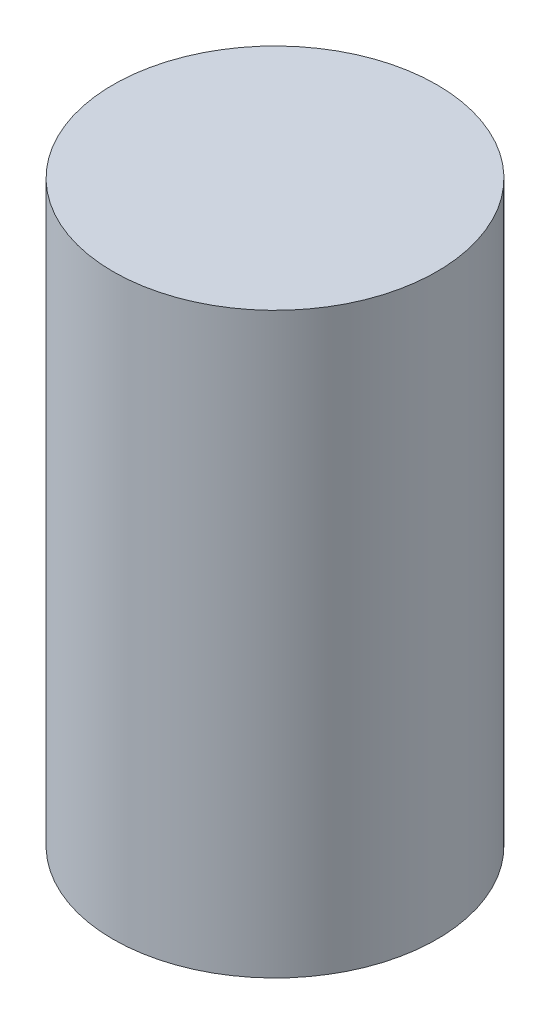
ISO-10303-21;
HEADER;
FILE_DESCRIPTION(('STEP AP214'),'2;1');
FILE_NAME('part.step','',(''),(''),'','','');
FILE_SCHEMA(('AUTOMOTIVE_DESIGN { 1 0 10303 214 1 1 1 1 }'));
ENDSEC;
DATA;
#1=APPLICATION_CONTEXT('core data for automotive mechanical design processes');
#2=APPLICATION_PROTOCOL_DEFINITION('international standard','automotive_design',2000,#1);
#3=PRODUCT_CONTEXT('',#1,'mechanical');
#4=PRODUCT('Part','Part','',(#3));
#5=PRODUCT_RELATED_PRODUCT_CATEGORY('part','',(#4));
#6=PRODUCT_DEFINITION_FORMATION('','',#4);
#7=PRODUCT_DEFINITION_CONTEXT('part definition',#1,'design');
#8=PRODUCT_DEFINITION('design','',#6,#7);
#9=PRODUCT_DEFINITION_SHAPE('','',#8);
#10=(LENGTH_UNIT() NAMED_UNIT(*) SI_UNIT(.MILLI.,.METRE.));
#11=(NAMED_UNIT(*) PLANE_ANGLE_UNIT() SI_UNIT($,.RADIAN.));
#12=(NAMED_UNIT(*) SI_UNIT($,.STERADIAN.) SOLID_ANGLE_UNIT());
#13=UNCERTAINTY_MEASURE_WITH_UNIT(LENGTH_MEASURE(1.E-05),#10,'distance_accuracy_value','');
#14=(GEOMETRIC_REPRESENTATION_CONTEXT(3) GLOBAL_UNCERTAINTY_ASSIGNED_CONTEXT((#13)) GLOBAL_UNIT_ASSIGNED_CONTEXT((#10,
#11,#12)) REPRESENTATION_CONTEXT('',''));
#15=CARTESIAN_POINT('',(0.,0.,0.));
#16=DIRECTION('',(0.,0.,1.));
#17=DIRECTION('',(1.,0.,0.));
#18=AXIS2_PLACEMENT_3D('',#15,#16,#17);
#19=CARTESIAN_POINT('',(0.,25.,0.));
#20=DIRECTION('',(0.,-1.,0.));
#21=DIRECTION('',(0.,0.,-1.));
#22=AXIS2_PLACEMENT_3D('',#19,#20,#21);
#23=CYLINDRICAL_SURFACE('',#22,7.);
#24=CARTESIAN_POINT('',(0.,25.,0.));
#25=DIRECTION('',(0.,1.,0.));
#26=DIRECTION('',(0.,0.,1.));
#27=AXIS2_PLACEMENT_3D('',#24,#25,#26);
#28=CIRCLE('',#27,7.);
#29=CARTESIAN_POINT('',(0.,25.,7.));
#30=VERTEX_POINT('',#29);
#31=EDGE_CURVE('E10',#30,#30,#28,.T.);
#32=ORIENTED_EDGE('',*,*,#31,.F.);
#33=EDGE_LOOP('',(#32));
#34=FACE_BOUND('',#33,.T.);
#35=CARTESIAN_POINT('',(0.,0.,0.));
#36=DIRECTION('',(0.,1.,0.));
#37=DIRECTION('',(0.,0.,1.));
#38=AXIS2_PLACEMENT_3D('',#35,#36,#37);
#39=CIRCLE('',#38,7.);
#40=CARTESIAN_POINT('',(0.,0.,7.));
#41=VERTEX_POINT('',#40);
#42=EDGE_CURVE('E39',#41,#41,#39,.T.);
#43=ORIENTED_EDGE('',*,*,#42,.T.);
#44=EDGE_LOOP('',(#43));
#45=FACE_BOUND('',#44,.T.);
#46=ADVANCED_FACE('F36',(#34,#45),#23,.T.);
#47=CARTESIAN_POINT('',(0.,25.,0.));
#48=DIRECTION('',(0.,1.,0.));
#49=DIRECTION('',(0.,0.,1.));
#50=AXIS2_PLACEMENT_3D('',#47,#48,#49);
#51=PLANE('',#50);
#52=ORIENTED_EDGE('',*,*,#31,.T.);
#53=EDGE_LOOP('',(#52));
#54=FACE_BOUND('',#53,.T.);
#55=ADVANCED_FACE('F51',(#54),#51,.T.);
#56=CARTESIAN_POINT('',(0.,0.,0.));
#57=DIRECTION('',(0.,1.,0.));
#58=DIRECTION('',(0.,0.,1.));
#59=AXIS2_PLACEMENT_3D('',#56,#57,#58);
#60=PLANE('',#59);
#61=ORIENTED_EDGE('',*,*,#42,.F.);
#62=EDGE_LOOP('',(#61));
#63=FACE_BOUND('',#62,.T.);
#64=ADVANCED_FACE('F49',(#63),#60,.F.);
#65=CLOSED_SHELL('',(#46,#55,#64));
#66=MANIFOLD_SOLID_BREP('B2',#65);
#67=ADVANCED_BREP_SHAPE_REPRESENTATION('',(#18,#66),#14);
#68=SHAPE_DEFINITION_REPRESENTATION(#9,#67);
ENDSEC;
END-ISO-10303-21;
